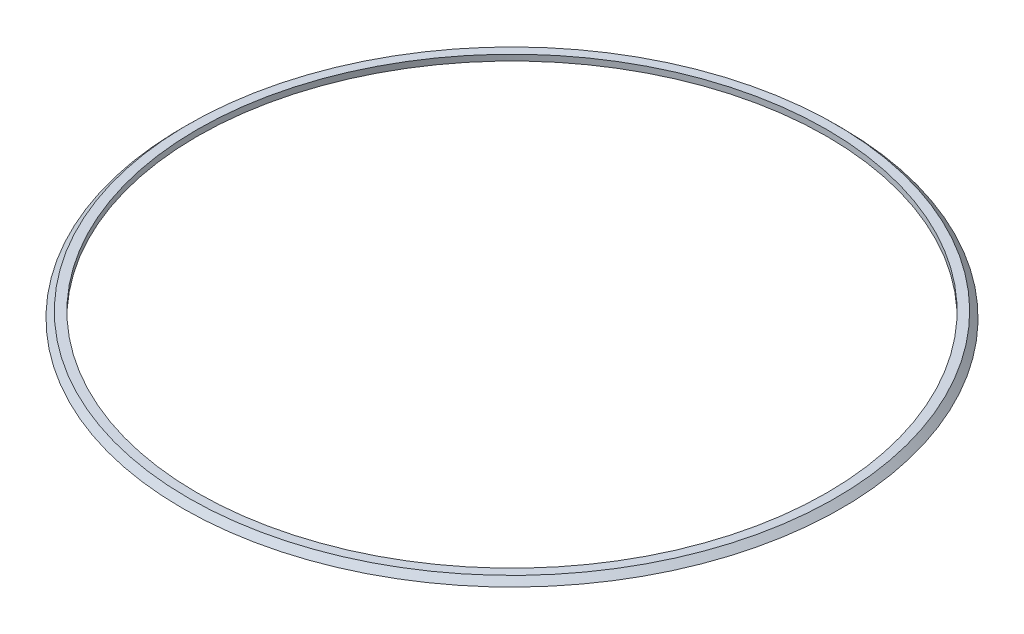
ISO-10303-21;
HEADER;
FILE_DESCRIPTION(('STEP AP214'),'2;1');
FILE_NAME('part.step','',(''),(''),'','','');
FILE_SCHEMA(('AUTOMOTIVE_DESIGN { 1 0 10303 214 1 1 1 1 }'));
ENDSEC;
DATA;
#1=APPLICATION_CONTEXT('core data for automotive mechanical design processes');
#2=APPLICATION_PROTOCOL_DEFINITION('international standard','automotive_design',2000,#1);
#3=PRODUCT_CONTEXT('',#1,'mechanical');
#4=PRODUCT('Part','Part','',(#3));
#5=PRODUCT_RELATED_PRODUCT_CATEGORY('part','',(#4));
#6=PRODUCT_DEFINITION_FORMATION('','',#4);
#7=PRODUCT_DEFINITION_CONTEXT('part definition',#1,'design');
#8=PRODUCT_DEFINITION('design','',#6,#7);
#9=PRODUCT_DEFINITION_SHAPE('','',#8);
#10=(LENGTH_UNIT() NAMED_UNIT(*) SI_UNIT(.MILLI.,.METRE.));
#11=(NAMED_UNIT(*) PLANE_ANGLE_UNIT() SI_UNIT($,.RADIAN.));
#12=(NAMED_UNIT(*) SI_UNIT($,.STERADIAN.) SOLID_ANGLE_UNIT());
#13=UNCERTAINTY_MEASURE_WITH_UNIT(LENGTH_MEASURE(1.E-05),#10,'distance_accuracy_value','');
#14=(GEOMETRIC_REPRESENTATION_CONTEXT(3) GLOBAL_UNCERTAINTY_ASSIGNED_CONTEXT((#13)) GLOBAL_UNIT_ASSIGNED_CONTEXT((#10,
#11,#12)) REPRESENTATION_CONTEXT('',''));
#15=CARTESIAN_POINT('',(0.,0.,0.));
#16=DIRECTION('',(0.,0.,1.));
#17=DIRECTION('',(1.,0.,0.));
#18=AXIS2_PLACEMENT_3D('',#15,#16,#17);
#19=CARTESIAN_POINT('',(0.,0.8,0.));
#20=DIRECTION('',(0.,1.,0.));
#21=DIRECTION('',(0.,0.,1.));
#22=AXIS2_PLACEMENT_3D('',#19,#20,#21);
#23=PLANE('',#22);
#24=CARTESIAN_POINT('',(0.,0.8,0.));
#25=DIRECTION('',(0.,1.,0.));
#26=DIRECTION('',(0.,0.,1.));
#27=AXIS2_PLACEMENT_3D('',#24,#25,#26);
#28=CIRCLE('',#27,43.7);
#29=CARTESIAN_POINT('',(0.,0.8,43.7));
#30=VERTEX_POINT('',#29);
#31=EDGE_CURVE('E10',#30,#30,#28,.T.);
#32=ORIENTED_EDGE('',*,*,#31,.T.);
#33=EDGE_LOOP('',(#32));
#34=FACE_BOUND('',#33,.T.);
#35=CARTESIAN_POINT('',(0.,0.8,0.));
#36=DIRECTION('',(0.,1.,0.));
#37=DIRECTION('',(0.,0.,1.));
#38=AXIS2_PLACEMENT_3D('',#35,#36,#37);
#39=CIRCLE('',#38,42.5);
#40=CARTESIAN_POINT('',(0.,0.8,42.5));
#41=VERTEX_POINT('',#40);
#42=EDGE_CURVE('E42',#41,#41,#39,.T.);
#43=ORIENTED_EDGE('',*,*,#42,.F.);
#44=EDGE_LOOP('',(#43));
#45=FACE_BOUND('',#44,.T.);
#46=ADVANCED_FACE('F31',(#34,#45),#23,.T.);
#47=CARTESIAN_POINT('',(0.,0.,0.));
#48=DIRECTION('',(0.,1.,0.));
#49=DIRECTION('',(0.,0.,1.));
#50=AXIS2_PLACEMENT_3D('',#47,#48,#49);
#51=PLANE('',#50);
#52=CARTESIAN_POINT('',(0.,0.,0.));
#53=DIRECTION('',(0.,1.,0.));
#54=DIRECTION('',(0.,0.,1.));
#55=AXIS2_PLACEMENT_3D('',#52,#53,#54);
#56=CIRCLE('',#55,44.5);
#57=CARTESIAN_POINT('',(0.,0.,44.5));
#58=VERTEX_POINT('',#57);
#59=EDGE_CURVE('E38',#58,#58,#56,.T.);
#60=ORIENTED_EDGE('',*,*,#59,.F.);
#61=EDGE_LOOP('',(#60));
#62=FACE_BOUND('',#61,.T.);
#63=CARTESIAN_POINT('',(0.,0.,0.));
#64=DIRECTION('',(0.,1.,0.));
#65=DIRECTION('',(0.,0.,1.));
#66=AXIS2_PLACEMENT_3D('',#63,#64,#65);
#67=CIRCLE('',#66,42.5);
#68=CARTESIAN_POINT('',(0.,0.,42.5));
#69=VERTEX_POINT('',#68);
#70=EDGE_CURVE('E46',#69,#69,#67,.T.);
#71=ORIENTED_EDGE('',*,*,#70,.T.);
#72=EDGE_LOOP('',(#71));
#73=FACE_BOUND('',#72,.T.);
#74=ADVANCED_FACE('F52',(#62,#73),#51,.F.);
#75=CARTESIAN_POINT('',(0.,0.8,0.));
#76=DIRECTION('',(0.,-1.,0.));
#77=DIRECTION('',(0.,0.,-1.));
#78=AXIS2_PLACEMENT_3D('',#75,#76,#77);
#79=CYLINDRICAL_SURFACE('',#78,42.5);
#80=ORIENTED_EDGE('',*,*,#42,.T.);
#81=EDGE_LOOP('',(#80));
#82=FACE_BOUND('',#81,.T.);
#83=ORIENTED_EDGE('',*,*,#70,.F.);
#84=EDGE_LOOP('',(#83));
#85=FACE_BOUND('',#84,.T.);
#86=ADVANCED_FACE('F54',(#82,#85),#79,.F.);
#87=CARTESIAN_POINT('',(0.,0.8,0.));
#88=DIRECTION('',(0.,-1.,0.));
#89=DIRECTION('',(0.,0.,-1.));
#90=AXIS2_PLACEMENT_3D('',#87,#88,#89);
#91=CONICAL_SURFACE('',#90,43.7,0.785398163397466);
#92=ORIENTED_EDGE('',*,*,#59,.T.);
#93=EDGE_LOOP('',(#92));
#94=FACE_BOUND('',#93,.T.);
#95=ORIENTED_EDGE('',*,*,#31,.F.);
#96=EDGE_LOOP('',(#95));
#97=FACE_BOUND('',#96,.T.);
#98=ADVANCED_FACE('F33',(#94,#97),#91,.T.);
#99=CLOSED_SHELL('',(#46,#74,#86,#98));
#100=MANIFOLD_SOLID_BREP('B2',#99);
#101=ADVANCED_BREP_SHAPE_REPRESENTATION('',(#18,#100),#14);
#102=SHAPE_DEFINITION_REPRESENTATION(#9,#101);
ENDSEC;
END-ISO-10303-21;
